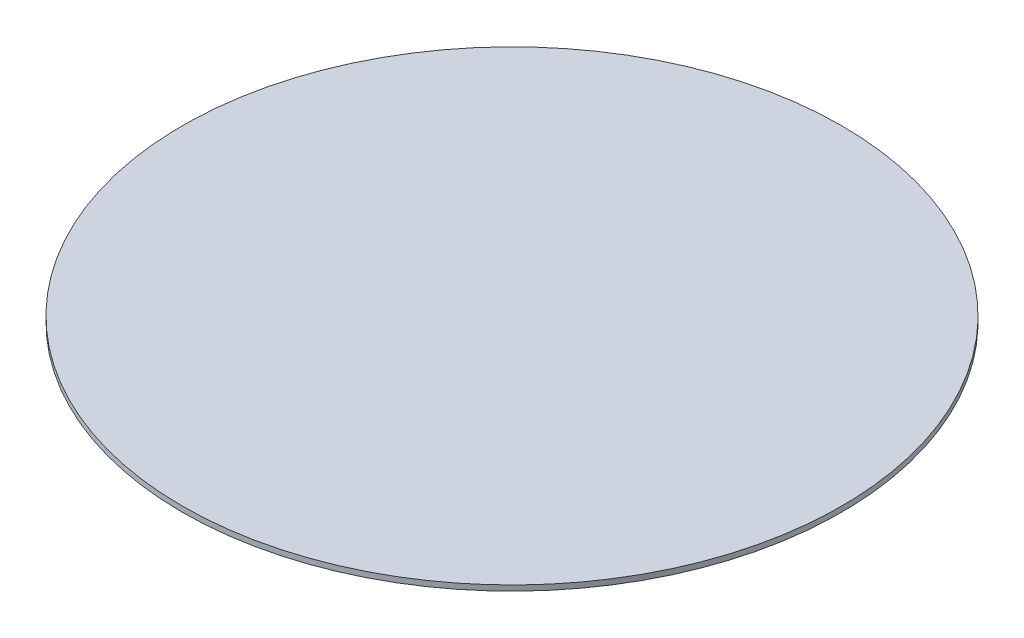
ISO-10303-21;
HEADER;
FILE_DESCRIPTION(('STEP AP214'),'2;1');
FILE_NAME('part.step','',(''),(''),'','','');
FILE_SCHEMA(('AUTOMOTIVE_DESIGN { 1 0 10303 214 1 1 1 1 }'));
ENDSEC;
DATA;
#1=APPLICATION_CONTEXT('core data for automotive mechanical design processes');
#2=APPLICATION_PROTOCOL_DEFINITION('international standard','automotive_design',2000,#1);
#3=PRODUCT_CONTEXT('',#1,'mechanical');
#4=PRODUCT('Part','Part','',(#3));
#5=PRODUCT_RELATED_PRODUCT_CATEGORY('part','',(#4));
#6=PRODUCT_DEFINITION_FORMATION('','',#4);
#7=PRODUCT_DEFINITION_CONTEXT('part definition',#1,'design');
#8=PRODUCT_DEFINITION('design','',#6,#7);
#9=PRODUCT_DEFINITION_SHAPE('','',#8);
#10=(LENGTH_UNIT() NAMED_UNIT(*) SI_UNIT(.MILLI.,.METRE.));
#11=(NAMED_UNIT(*) PLANE_ANGLE_UNIT() SI_UNIT($,.RADIAN.));
#12=(NAMED_UNIT(*) SI_UNIT($,.STERADIAN.) SOLID_ANGLE_UNIT());
#13=UNCERTAINTY_MEASURE_WITH_UNIT(LENGTH_MEASURE(1.E-05),#10,'distance_accuracy_value','');
#14=(GEOMETRIC_REPRESENTATION_CONTEXT(3) GLOBAL_UNCERTAINTY_ASSIGNED_CONTEXT((#13)) GLOBAL_UNIT_ASSIGNED_CONTEXT((#10,
#11,#12)) REPRESENTATION_CONTEXT('',''));
#15=CARTESIAN_POINT('',(0.,0.,0.));
#16=DIRECTION('',(0.,0.,1.));
#17=DIRECTION('',(1.,0.,0.));
#18=AXIS2_PLACEMENT_3D('',#15,#16,#17);
#19=CARTESIAN_POINT('',(0.,2.07,0.));
#20=DIRECTION('',(0.,-1.,0.));
#21=DIRECTION('',(0.,0.,-1.));
#22=AXIS2_PLACEMENT_3D('',#19,#20,#21);
#23=CYLINDRICAL_SURFACE('',#22,127.);
#24=CARTESIAN_POINT('',(0.,2.07,0.));
#25=DIRECTION('',(0.,1.,0.));
#26=DIRECTION('',(0.,0.,1.));
#27=AXIS2_PLACEMENT_3D('',#24,#25,#26);
#28=CIRCLE('',#27,127.);
#29=CARTESIAN_POINT('',(0.,2.07,127.));
#30=VERTEX_POINT('',#29);
#31=EDGE_CURVE('E10',#30,#30,#28,.T.);
#32=ORIENTED_EDGE('',*,*,#31,.F.);
#33=EDGE_LOOP('',(#32));
#34=FACE_BOUND('',#33,.T.);
#35=CARTESIAN_POINT('',(0.,0.,0.));
#36=DIRECTION('',(0.,1.,0.));
#37=DIRECTION('',(0.,0.,1.));
#38=AXIS2_PLACEMENT_3D('',#35,#36,#37);
#39=CIRCLE('',#38,127.);
#40=CARTESIAN_POINT('',(0.,0.,127.));
#41=VERTEX_POINT('',#40);
#42=EDGE_CURVE('E36',#41,#41,#39,.T.);
#43=ORIENTED_EDGE('',*,*,#42,.T.);
#44=EDGE_LOOP('',(#43));
#45=FACE_BOUND('',#44,.T.);
#46=ADVANCED_FACE('F33',(#34,#45),#23,.T.);
#47=CARTESIAN_POINT('',(0.,2.07,0.));
#48=DIRECTION('',(0.,1.,0.));
#49=DIRECTION('',(0.,0.,1.));
#50=AXIS2_PLACEMENT_3D('',#47,#48,#49);
#51=PLANE('',#50);
#52=ORIENTED_EDGE('',*,*,#31,.T.);
#53=EDGE_LOOP('',(#52));
#54=FACE_BOUND('',#53,.T.);
#55=ADVANCED_FACE('F48',(#54),#51,.T.);
#56=CARTESIAN_POINT('',(0.,0.,0.));
#57=DIRECTION('',(0.,1.,0.));
#58=DIRECTION('',(0.,0.,1.));
#59=AXIS2_PLACEMENT_3D('',#56,#57,#58);
#60=PLANE('',#59);
#61=ORIENTED_EDGE('',*,*,#42,.F.);
#62=EDGE_LOOP('',(#61));
#63=FACE_BOUND('',#62,.T.);
#64=ADVANCED_FACE('F46',(#63),#60,.F.);
#65=CLOSED_SHELL('',(#46,#55,#64));
#66=MANIFOLD_SOLID_BREP('B2',#65);
#67=ADVANCED_BREP_SHAPE_REPRESENTATION('',(#18,#66),#14);
#68=SHAPE_DEFINITION_REPRESENTATION(#9,#67);
ENDSEC;
END-ISO-10303-21;
